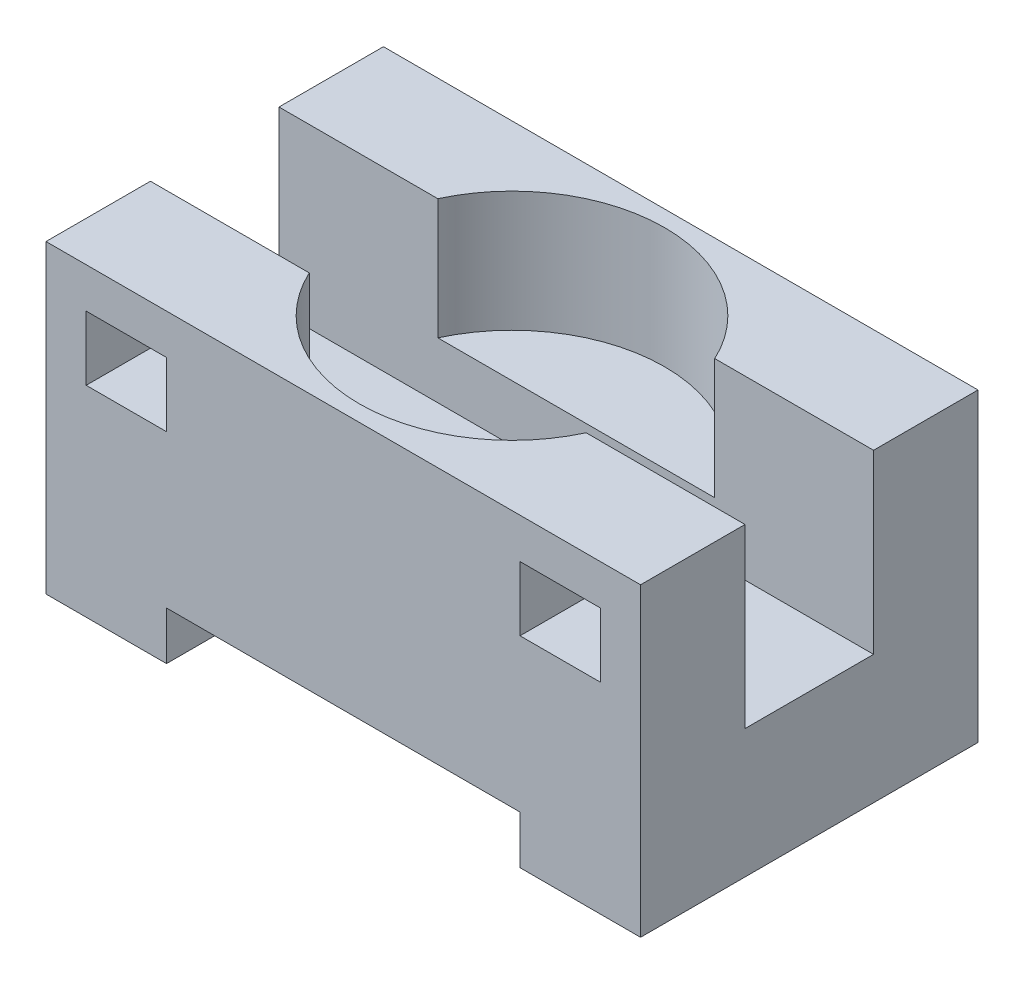
ISO-10303-21;
HEADER;
FILE_DESCRIPTION(('STEP AP214'),'2;1');
FILE_NAME('part.step','',(''),(''),'','','');
FILE_SCHEMA(('AUTOMOTIVE_DESIGN { 1 0 10303 214 1 1 1 1 }'));
ENDSEC;
DATA;
#1=APPLICATION_CONTEXT('core data for automotive mechanical design processes');
#2=APPLICATION_PROTOCOL_DEFINITION('international standard','automotive_design',2000,#1);
#3=PRODUCT_CONTEXT('',#1,'mechanical');
#4=PRODUCT('Part','Part','',(#3));
#5=PRODUCT_RELATED_PRODUCT_CATEGORY('part','',(#4));
#6=PRODUCT_DEFINITION_FORMATION('','',#4);
#7=PRODUCT_DEFINITION_CONTEXT('part definition',#1,'design');
#8=PRODUCT_DEFINITION('design','',#6,#7);
#9=PRODUCT_DEFINITION_SHAPE('','',#8);
#10=(LENGTH_UNIT() NAMED_UNIT(*) SI_UNIT(.MILLI.,.METRE.));
#11=(NAMED_UNIT(*) PLANE_ANGLE_UNIT() SI_UNIT($,.RADIAN.));
#12=(NAMED_UNIT(*) SI_UNIT($,.STERADIAN.) SOLID_ANGLE_UNIT());
#13=UNCERTAINTY_MEASURE_WITH_UNIT(LENGTH_MEASURE(1.E-05),#10,'distance_accuracy_value','');
#14=(GEOMETRIC_REPRESENTATION_CONTEXT(3) GLOBAL_UNCERTAINTY_ASSIGNED_CONTEXT((#13)) GLOBAL_UNIT_ASSIGNED_CONTEXT((#10,
#11,#12)) REPRESENTATION_CONTEXT('',''));
#15=CARTESIAN_POINT('',(0.,0.,0.));
#16=DIRECTION('',(0.,0.,1.));
#17=DIRECTION('',(1.,0.,0.));
#18=AXIS2_PLACEMENT_3D('',#15,#16,#17);
#19=CARTESIAN_POINT('',(-37.,19.,42.));
#20=DIRECTION('',(0.,-1.,0.));
#21=DIRECTION('',(0.,0.,-1.));
#22=AXIS2_PLACEMENT_3D('',#19,#20,#21);
#23=PLANE('',#22);
#24=DIRECTION('',(1.,0.,0.));
#25=VECTOR('',#24,1.);
#26=CARTESIAN_POINT('',(-37.,19.,29.));
#27=LINE('',#26,#25);
#28=CARTESIAN_POINT('',(17.2336879396141,19.,29.));
#29=VERTEX_POINT('',#28);
#30=CARTESIAN_POINT('',(37.,19.,29.));
#31=VERTEX_POINT('',#30);
#32=EDGE_CURVE('E288',#29,#31,#27,.T.);
#33=ORIENTED_EDGE('',*,*,#32,.F.);
#34=CARTESIAN_POINT('',(0.,19.,21.));
#35=DIRECTION('',(0.,1.,0.));
#36=DIRECTION('',(0.,0.,1.));
#37=AXIS2_PLACEMENT_3D('',#34,#35,#36);
#38=CIRCLE('',#37,19.);
#39=CARTESIAN_POINT('',(-17.2336879396141,19.,29.));
#40=VERTEX_POINT('',#39);
#41=EDGE_CURVE('E231',#40,#29,#38,.T.);
#42=ORIENTED_EDGE('',*,*,#41,.F.);
#43=CARTESIAN_POINT('',(-37.,19.,29.));
#44=VERTEX_POINT('',#43);
#45=EDGE_CURVE('E284',#44,#40,#27,.T.);
#46=ORIENTED_EDGE('',*,*,#45,.F.);
#47=DIRECTION('',(0.,0.,-1.));
#48=VECTOR('',#47,1.);
#49=CARTESIAN_POINT('',(-37.,19.,42.));
#50=LINE('',#49,#48);
#51=CARTESIAN_POINT('',(-37.,19.,42.));
#52=VERTEX_POINT('',#51);
#53=EDGE_CURVE('E351',#52,#44,#50,.T.);
#54=ORIENTED_EDGE('',*,*,#53,.F.);
#55=DIRECTION('',(-1.,0.,0.));
#56=VECTOR('',#55,1.);
#57=CARTESIAN_POINT('',(-37.,19.,42.));
#58=LINE('',#57,#56);
#59=CARTESIAN_POINT('',(37.,19.,42.));
#60=VERTEX_POINT('',#59);
#61=EDGE_CURVE('E325',#60,#52,#58,.T.);
#62=ORIENTED_EDGE('',*,*,#61,.F.);
#63=DIRECTION('',(0.,0.,-1.));
#64=VECTOR('',#63,1.);
#65=CARTESIAN_POINT('',(37.,19.,42.));
#66=LINE('',#65,#64);
#67=EDGE_CURVE('E355',#60,#31,#66,.T.);
#68=ORIENTED_EDGE('',*,*,#67,.T.);
#69=EDGE_LOOP('',(#33,#42,#46,#54,#62,#68));
#70=FACE_BOUND('',#69,.T.);
#71=ADVANCED_FACE('F39',(#70),#23,.F.);
#72=CARTESIAN_POINT('',(-37.,-19.,42.));
#73=DIRECTION('',(0.,1.,0.));
#74=DIRECTION('',(0.,0.,1.));
#75=AXIS2_PLACEMENT_3D('',#72,#73,#74);
#76=PLANE('',#75);
#77=DIRECTION('',(1.,0.,0.));
#78=VECTOR('',#77,1.);
#79=CARTESIAN_POINT('',(-37.,-19.,42.));
#80=LINE('',#79,#78);
#81=CARTESIAN_POINT('',(22.,-19.,42.));
#82=VERTEX_POINT('',#81);
#83=CARTESIAN_POINT('',(37.,-19.,42.));
#84=VERTEX_POINT('',#83);
#85=EDGE_CURVE('E330',#82,#84,#80,.T.);
#86=ORIENTED_EDGE('',*,*,#85,.F.);
#87=DIRECTION('',(0.,0.,-1.));
#88=VECTOR('',#87,1.);
#89=CARTESIAN_POINT('',(22.,-19.,42.));
#90=LINE('',#89,#88);
#91=CARTESIAN_POINT('',(22.,-19.,0.));
#92=VERTEX_POINT('',#91);
#93=EDGE_CURVE('E306',#82,#92,#90,.T.);
#94=ORIENTED_EDGE('',*,*,#93,.T.);
#95=DIRECTION('',(1.,0.,0.));
#96=VECTOR('',#95,1.);
#97=CARTESIAN_POINT('',(-37.,-19.,0.));
#98=LINE('',#97,#96);
#99=CARTESIAN_POINT('',(37.,-19.,0.));
#100=VERTEX_POINT('',#99);
#101=EDGE_CURVE('E342',#92,#100,#98,.T.);
#102=ORIENTED_EDGE('',*,*,#101,.T.);
#103=DIRECTION('',(0.,0.,-1.));
#104=VECTOR('',#103,1.);
#105=CARTESIAN_POINT('',(37.,-19.,42.));
#106=LINE('',#105,#104);
#107=EDGE_CURVE('E334',#84,#100,#106,.T.);
#108=ORIENTED_EDGE('',*,*,#107,.F.);
#109=EDGE_LOOP('',(#86,#94,#102,#108));
#110=FACE_BOUND('',#109,.T.);
#111=ADVANCED_FACE('F402',(#110),#76,.F.);
#112=CARTESIAN_POINT('',(37.,19.,42.));
#113=DIRECTION('',(-1.,0.,0.));
#114=DIRECTION('',(0.,0.,1.));
#115=AXIS2_PLACEMENT_3D('',#112,#113,#114);
#116=PLANE('',#115);
#117=DIRECTION('',(0.,0.,-1.));
#118=VECTOR('',#117,1.);
#119=CARTESIAN_POINT('',(37.,-3.,29.));
#120=LINE('',#119,#118);
#121=CARTESIAN_POINT('',(37.,-3.,29.));
#122=VERTEX_POINT('',#121);
#123=CARTESIAN_POINT('',(37.,-3.,13.));
#124=VERTEX_POINT('',#123);
#125=EDGE_CURVE('E279',#122,#124,#120,.T.);
#126=ORIENTED_EDGE('',*,*,#125,.F.);
#127=DIRECTION('',(0.,-1.,0.));
#128=VECTOR('',#127,1.);
#129=CARTESIAN_POINT('',(37.,19.,29.));
#130=LINE('',#129,#128);
#131=EDGE_CURVE('E265',#31,#122,#130,.T.);
#132=ORIENTED_EDGE('',*,*,#131,.F.);
#133=ORIENTED_EDGE('',*,*,#67,.F.);
#134=DIRECTION('',(0.,1.,0.));
#135=VECTOR('',#134,1.);
#136=CARTESIAN_POINT('',(37.,19.,42.));
#137=LINE('',#136,#135);
#138=EDGE_CURVE('E322',#84,#60,#137,.T.);
#139=ORIENTED_EDGE('',*,*,#138,.F.);
#140=ORIENTED_EDGE('',*,*,#107,.T.);
#141=DIRECTION('',(0.,1.,0.));
#142=VECTOR('',#141,1.);
#143=CARTESIAN_POINT('',(37.,19.,0.));
#144=LINE('',#143,#142);
#145=CARTESIAN_POINT('',(37.,19.,0.));
#146=VERTEX_POINT('',#145);
#147=EDGE_CURVE('E315',#100,#146,#144,.T.);
#148=ORIENTED_EDGE('',*,*,#147,.T.);
#149=CARTESIAN_POINT('',(37.,19.,13.));
#150=VERTEX_POINT('',#149);
#151=EDGE_CURVE('E354',#150,#146,#66,.T.);
#152=ORIENTED_EDGE('',*,*,#151,.F.);
#153=DIRECTION('',(0.,1.,0.));
#154=VECTOR('',#153,1.);
#155=CARTESIAN_POINT('',(37.,19.,13.));
#156=LINE('',#155,#154);
#157=EDGE_CURVE('E270',#124,#150,#156,.T.);
#158=ORIENTED_EDGE('',*,*,#157,.F.);
#159=EDGE_LOOP('',(#126,#132,#133,#139,#140,#148,#152,#158));
#160=FACE_BOUND('',#159,.T.);
#161=ADVANCED_FACE('F41',(#160),#116,.F.);
#162=DIRECTION('',(1.,0.,0.));
#163=VECTOR('',#162,1.);
#164=CARTESIAN_POINT('',(-37.,19.,13.));
#165=LINE('',#164,#163);
#166=CARTESIAN_POINT('',(-37.,19.,13.));
#167=VERTEX_POINT('',#166);
#168=CARTESIAN_POINT('',(-17.2336879396141,19.,13.));
#169=VERTEX_POINT('',#168);
#170=EDGE_CURVE('E289',#167,#169,#165,.T.);
#171=ORIENTED_EDGE('',*,*,#170,.T.);
#172=CARTESIAN_POINT('',(17.2336879396141,19.,13.));
#173=VERTEX_POINT('',#172);
#174=EDGE_CURVE('E255',#173,#169,#38,.T.);
#175=ORIENTED_EDGE('',*,*,#174,.F.);
#176=EDGE_CURVE('E292',#173,#150,#165,.T.);
#177=ORIENTED_EDGE('',*,*,#176,.T.);
#178=ORIENTED_EDGE('',*,*,#151,.T.);
#179=DIRECTION('',(-1.,0.,0.));
#180=VECTOR('',#179,1.);
#181=CARTESIAN_POINT('',(-37.,19.,0.));
#182=LINE('',#181,#180);
#183=CARTESIAN_POINT('',(-37.,19.,0.));
#184=VERTEX_POINT('',#183);
#185=EDGE_CURVE('E337',#146,#184,#182,.T.);
#186=ORIENTED_EDGE('',*,*,#185,.T.);
#187=EDGE_CURVE('E350',#167,#184,#50,.T.);
#188=ORIENTED_EDGE('',*,*,#187,.F.);
#189=EDGE_LOOP('',(#171,#175,#177,#178,#186,#188));
#190=FACE_BOUND('',#189,.T.);
#191=ADVANCED_FACE('F404',(#190),#23,.F.);
#192=CARTESIAN_POINT('',(-37.,19.,42.));
#193=DIRECTION('',(1.,0.,0.));
#194=DIRECTION('',(0.,0.,-1.));
#195=AXIS2_PLACEMENT_3D('',#192,#193,#194);
#196=PLANE('',#195);
#197=ORIENTED_EDGE('',*,*,#53,.T.);
#198=DIRECTION('',(0.,-1.,0.));
#199=VECTOR('',#198,1.);
#200=CARTESIAN_POINT('',(-37.,19.,29.));
#201=LINE('',#200,#199);
#202=CARTESIAN_POINT('',(-37.,-3.,29.));
#203=VERTEX_POINT('',#202);
#204=EDGE_CURVE('E266',#44,#203,#201,.T.);
#205=ORIENTED_EDGE('',*,*,#204,.T.);
#206=DIRECTION('',(0.,0.,-1.));
#207=VECTOR('',#206,1.);
#208=CARTESIAN_POINT('',(-37.,-3.,29.));
#209=LINE('',#208,#207);
#210=CARTESIAN_POINT('',(-37.,-3.,13.));
#211=VERTEX_POINT('',#210);
#212=EDGE_CURVE('E269',#203,#211,#209,.T.);
#213=ORIENTED_EDGE('',*,*,#212,.T.);
#214=DIRECTION('',(0.,1.,0.));
#215=VECTOR('',#214,1.);
#216=CARTESIAN_POINT('',(-37.,19.,13.));
#217=LINE('',#216,#215);
#218=EDGE_CURVE('E273',#211,#167,#217,.T.);
#219=ORIENTED_EDGE('',*,*,#218,.T.);
#220=ORIENTED_EDGE('',*,*,#187,.T.);
#221=DIRECTION('',(0.,-1.,0.));
#222=VECTOR('',#221,1.);
#223=CARTESIAN_POINT('',(-37.,19.,0.));
#224=LINE('',#223,#222);
#225=CARTESIAN_POINT('',(-37.,-19.,0.));
#226=VERTEX_POINT('',#225);
#227=EDGE_CURVE('E340',#184,#226,#224,.T.);
#228=ORIENTED_EDGE('',*,*,#227,.T.);
#229=DIRECTION('',(0.,0.,-1.));
#230=VECTOR('',#229,1.);
#231=CARTESIAN_POINT('',(-37.,-19.,42.));
#232=LINE('',#231,#230);
#233=CARTESIAN_POINT('',(-37.,-19.,42.));
#234=VERTEX_POINT('',#233);
#235=EDGE_CURVE('E347',#234,#226,#232,.T.);
#236=ORIENTED_EDGE('',*,*,#235,.F.);
#237=DIRECTION('',(0.,-1.,0.));
#238=VECTOR('',#237,1.);
#239=CARTESIAN_POINT('',(-37.,19.,42.));
#240=LINE('',#239,#238);
#241=EDGE_CURVE('E328',#52,#234,#240,.T.);
#242=ORIENTED_EDGE('',*,*,#241,.F.);
#243=EDGE_LOOP('',(#197,#205,#213,#219,#220,#228,#236,#242));
#244=FACE_BOUND('',#243,.T.);
#245=ADVANCED_FACE('F415',(#244),#196,.F.);
#246=CARTESIAN_POINT('',(-22.,-19.,0.));
#247=VERTEX_POINT('',#246);
#248=EDGE_CURVE('E326',#226,#247,#98,.T.);
#249=ORIENTED_EDGE('',*,*,#248,.T.);
#250=DIRECTION('',(0.,0.,-1.));
#251=VECTOR('',#250,1.);
#252=CARTESIAN_POINT('',(-22.,-19.,42.));
#253=LINE('',#252,#251);
#254=CARTESIAN_POINT('',(-22.,-19.,42.));
#255=VERTEX_POINT('',#254);
#256=EDGE_CURVE('E318',#255,#247,#253,.T.);
#257=ORIENTED_EDGE('',*,*,#256,.F.);
#258=EDGE_CURVE('E331',#234,#255,#80,.T.);
#259=ORIENTED_EDGE('',*,*,#258,.F.);
#260=ORIENTED_EDGE('',*,*,#235,.T.);
#261=EDGE_LOOP('',(#249,#257,#259,#260));
#262=FACE_BOUND('',#261,.T.);
#263=ADVANCED_FACE('F412',(#262),#76,.F.);
#264=CARTESIAN_POINT('',(0.,0.,42.));
#265=DIRECTION('',(0.,0.,1.));
#266=DIRECTION('',(1.,0.,0.));
#267=AXIS2_PLACEMENT_3D('',#264,#265,#266);
#268=PLANE('',#267);
#269=DIRECTION('',(0.,-1.,0.));
#270=VECTOR('',#269,1.);
#271=CARTESIAN_POINT('',(-32.,14.,42.));
#272=LINE('',#271,#270);
#273=CARTESIAN_POINT('',(-32.,14.,42.));
#274=VERTEX_POINT('',#273);
#275=CARTESIAN_POINT('',(-32.,6.,42.));
#276=VERTEX_POINT('',#275);
#277=EDGE_CURVE('E54',#274,#276,#272,.T.);
#278=ORIENTED_EDGE('',*,*,#277,.F.);
#279=DIRECTION('',(-1.,0.,0.));
#280=VECTOR('',#279,1.);
#281=CARTESIAN_POINT('',(-32.,14.,42.));
#282=LINE('',#281,#280);
#283=CARTESIAN_POINT('',(-22.,14.,42.));
#284=VERTEX_POINT('',#283);
#285=EDGE_CURVE('E224',#284,#274,#282,.T.);
#286=ORIENTED_EDGE('',*,*,#285,.F.);
#287=DIRECTION('',(0.,1.,0.));
#288=VECTOR('',#287,1.);
#289=CARTESIAN_POINT('',(-22.,14.,42.));
#290=LINE('',#289,#288);
#291=CARTESIAN_POINT('',(-22.,6.,42.));
#292=VERTEX_POINT('',#291);
#293=EDGE_CURVE('E207',#292,#284,#290,.T.);
#294=ORIENTED_EDGE('',*,*,#293,.F.);
#295=DIRECTION('',(1.,0.,0.));
#296=VECTOR('',#295,1.);
#297=CARTESIAN_POINT('',(-32.,6.,42.));
#298=LINE('',#297,#296);
#299=EDGE_CURVE('E217',#276,#292,#298,.T.);
#300=ORIENTED_EDGE('',*,*,#299,.F.);
#301=EDGE_LOOP('',(#278,#286,#294,#300));
#302=FACE_BOUND('',#301,.T.);
#303=DIRECTION('',(-1.,0.,0.));
#304=VECTOR('',#303,1.);
#305=CARTESIAN_POINT('',(32.,14.,42.));
#306=LINE('',#305,#304);
#307=CARTESIAN_POINT('',(32.,14.,42.));
#308=VERTEX_POINT('',#307);
#309=CARTESIAN_POINT('',(22.,14.,42.));
#310=VERTEX_POINT('',#309);
#311=EDGE_CURVE('E62',#308,#310,#306,.T.);
#312=ORIENTED_EDGE('',*,*,#311,.F.);
#313=DIRECTION('',(0.,1.,0.));
#314=VECTOR('',#313,1.);
#315=CARTESIAN_POINT('',(32.,14.,42.));
#316=LINE('',#315,#314);
#317=CARTESIAN_POINT('',(32.,6.,42.));
#318=VERTEX_POINT('',#317);
#319=EDGE_CURVE('E236',#318,#308,#316,.T.);
#320=ORIENTED_EDGE('',*,*,#319,.F.);
#321=DIRECTION('',(1.,0.,0.));
#322=VECTOR('',#321,1.);
#323=CARTESIAN_POINT('',(32.,6.,42.));
#324=LINE('',#323,#322);
#325=CARTESIAN_POINT('',(22.,6.,42.));
#326=VERTEX_POINT('',#325);
#327=EDGE_CURVE('E245',#326,#318,#324,.T.);
#328=ORIENTED_EDGE('',*,*,#327,.F.);
#329=DIRECTION('',(0.,-1.,0.));
#330=VECTOR('',#329,1.);
#331=CARTESIAN_POINT('',(22.,14.,42.));
#332=LINE('',#331,#330);
#333=EDGE_CURVE('E248',#310,#326,#332,.T.);
#334=ORIENTED_EDGE('',*,*,#333,.F.);
#335=EDGE_LOOP('',(#312,#320,#328,#334));
#336=FACE_BOUND('',#335,.T.);
#337=DIRECTION('',(0.,-1.,0.));
#338=VECTOR('',#337,1.);
#339=CARTESIAN_POINT('',(22.,-19.,42.));
#340=LINE('',#339,#338);
#341=CARTESIAN_POINT('',(22.,-13.,42.));
#342=VERTEX_POINT('',#341);
#343=EDGE_CURVE('E296',#342,#82,#340,.T.);
#344=ORIENTED_EDGE('',*,*,#343,.T.);
#345=ORIENTED_EDGE('',*,*,#85,.T.);
#346=ORIENTED_EDGE('',*,*,#138,.T.);
#347=ORIENTED_EDGE('',*,*,#61,.T.);
#348=ORIENTED_EDGE('',*,*,#241,.T.);
#349=ORIENTED_EDGE('',*,*,#258,.T.);
#350=DIRECTION('',(0.,1.,0.));
#351=VECTOR('',#350,1.);
#352=CARTESIAN_POINT('',(-22.,-19.,42.));
#353=LINE('',#352,#351);
#354=CARTESIAN_POINT('',(-22.,-13.,42.));
#355=VERTEX_POINT('',#354);
#356=EDGE_CURVE('E299',#255,#355,#353,.T.);
#357=ORIENTED_EDGE('',*,*,#356,.T.);
#358=DIRECTION('',(1.,0.,0.));
#359=VECTOR('',#358,1.);
#360=CARTESIAN_POINT('',(22.,-13.,42.));
#361=LINE('',#360,#359);
#362=EDGE_CURVE('E303',#355,#342,#361,.T.);
#363=ORIENTED_EDGE('',*,*,#362,.T.);
#364=EDGE_LOOP('',(#344,#345,#346,#347,#348,#349,#357,#363));
#365=FACE_BOUND('',#364,.T.);
#366=ADVANCED_FACE('F221',(#302,#336,#365),#268,.T.);
#367=CARTESIAN_POINT('',(0.,0.,0.));
#368=DIRECTION('',(0.,0.,1.));
#369=DIRECTION('',(1.,0.,0.));
#370=AXIS2_PLACEMENT_3D('',#367,#368,#369);
#371=PLANE('',#370);
#372=ORIENTED_EDGE('',*,*,#101,.F.);
#373=DIRECTION('',(0.,-1.,0.));
#374=VECTOR('',#373,1.);
#375=CARTESIAN_POINT('',(22.,-19.,0.));
#376=LINE('',#375,#374);
#377=CARTESIAN_POINT('',(22.,-13.,0.));
#378=VERTEX_POINT('',#377);
#379=EDGE_CURVE('E287',#378,#92,#376,.T.);
#380=ORIENTED_EDGE('',*,*,#379,.F.);
#381=DIRECTION('',(1.,0.,0.));
#382=VECTOR('',#381,1.);
#383=CARTESIAN_POINT('',(22.,-13.,0.));
#384=LINE('',#383,#382);
#385=CARTESIAN_POINT('',(-22.,-13.,0.));
#386=VERTEX_POINT('',#385);
#387=EDGE_CURVE('E300',#386,#378,#384,.T.);
#388=ORIENTED_EDGE('',*,*,#387,.F.);
#389=DIRECTION('',(0.,1.,0.));
#390=VECTOR('',#389,1.);
#391=CARTESIAN_POINT('',(-22.,-19.,0.));
#392=LINE('',#391,#390);
#393=EDGE_CURVE('E308',#247,#386,#392,.T.);
#394=ORIENTED_EDGE('',*,*,#393,.F.);
#395=ORIENTED_EDGE('',*,*,#248,.F.);
#396=ORIENTED_EDGE('',*,*,#227,.F.);
#397=ORIENTED_EDGE('',*,*,#185,.F.);
#398=ORIENTED_EDGE('',*,*,#147,.F.);
#399=EDGE_LOOP('',(#372,#380,#388,#394,#395,#396,#397,#398));
#400=FACE_BOUND('',#399,.T.);
#401=ADVANCED_FACE('F443',(#400),#371,.F.);
#402=CARTESIAN_POINT('',(22.,-19.,42.));
#403=DIRECTION('',(1.,0.,0.));
#404=DIRECTION('',(0.,0.,-1.));
#405=AXIS2_PLACEMENT_3D('',#402,#403,#404);
#406=PLANE('',#405);
#407=ORIENTED_EDGE('',*,*,#379,.T.);
#408=ORIENTED_EDGE('',*,*,#93,.F.);
#409=ORIENTED_EDGE('',*,*,#343,.F.);
#410=DIRECTION('',(0.,0.,-1.));
#411=VECTOR('',#410,1.);
#412=CARTESIAN_POINT('',(22.,-13.,42.));
#413=LINE('',#412,#411);
#414=EDGE_CURVE('E313',#342,#378,#413,.T.);
#415=ORIENTED_EDGE('',*,*,#414,.T.);
#416=EDGE_LOOP('',(#407,#408,#409,#415));
#417=FACE_BOUND('',#416,.T.);
#418=ADVANCED_FACE('F466',(#417),#406,.F.);
#419=CARTESIAN_POINT('',(22.,-13.,42.));
#420=DIRECTION('',(0.,1.,0.));
#421=DIRECTION('',(0.,0.,1.));
#422=AXIS2_PLACEMENT_3D('',#419,#420,#421);
#423=PLANE('',#422);
#424=ORIENTED_EDGE('',*,*,#387,.T.);
#425=ORIENTED_EDGE('',*,*,#414,.F.);
#426=ORIENTED_EDGE('',*,*,#362,.F.);
#427=DIRECTION('',(0.,0.,-1.));
#428=VECTOR('',#427,1.);
#429=CARTESIAN_POINT('',(-22.,-13.,42.));
#430=LINE('',#429,#428);
#431=EDGE_CURVE('E316',#355,#386,#430,.T.);
#432=ORIENTED_EDGE('',*,*,#431,.T.);
#433=EDGE_LOOP('',(#424,#425,#426,#432));
#434=FACE_BOUND('',#433,.T.);
#435=ADVANCED_FACE('F469',(#434),#423,.F.);
#436=CARTESIAN_POINT('',(-22.,-19.,42.));
#437=DIRECTION('',(-1.,0.,0.));
#438=DIRECTION('',(0.,0.,1.));
#439=AXIS2_PLACEMENT_3D('',#436,#437,#438);
#440=PLANE('',#439);
#441=ORIENTED_EDGE('',*,*,#393,.T.);
#442=ORIENTED_EDGE('',*,*,#431,.F.);
#443=ORIENTED_EDGE('',*,*,#356,.F.);
#444=ORIENTED_EDGE('',*,*,#256,.T.);
#445=EDGE_LOOP('',(#441,#442,#443,#444));
#446=FACE_BOUND('',#445,.T.);
#447=ADVANCED_FACE('F471',(#446),#440,.F.);
#448=CARTESIAN_POINT('',(-37.,19.,29.));
#449=DIRECTION('',(0.,0.,1.));
#450=DIRECTION('',(0.,-1.,0.));
#451=AXIS2_PLACEMENT_3D('',#448,#449,#450);
#452=PLANE('',#451);
#453=DIRECTION('',(-1.,0.,0.));
#454=VECTOR('',#453,1.);
#455=CARTESIAN_POINT('',(-37.,14.,29.));
#456=LINE('',#455,#454);
#457=CARTESIAN_POINT('',(-22.,14.,29.));
#458=VERTEX_POINT('',#457);
#459=CARTESIAN_POINT('',(-32.,14.,29.));
#460=VERTEX_POINT('',#459);
#461=EDGE_CURVE('E47',#458,#460,#456,.T.);
#462=ORIENTED_EDGE('',*,*,#461,.T.);
#463=DIRECTION('',(0.,-1.,0.));
#464=VECTOR('',#463,1.);
#465=CARTESIAN_POINT('',(-32.,19.,29.));
#466=LINE('',#465,#464);
#467=CARTESIAN_POINT('',(-32.,6.,29.));
#468=VERTEX_POINT('',#467);
#469=EDGE_CURVE('E11',#460,#468,#466,.T.);
#470=ORIENTED_EDGE('',*,*,#469,.T.);
#471=DIRECTION('',(1.,0.,0.));
#472=VECTOR('',#471,1.);
#473=CARTESIAN_POINT('',(-37.,6.,29.));
#474=LINE('',#473,#472);
#475=CARTESIAN_POINT('',(-22.,6.,29.));
#476=VERTEX_POINT('',#475);
#477=EDGE_CURVE('E378',#468,#476,#474,.T.);
#478=ORIENTED_EDGE('',*,*,#477,.T.);
#479=DIRECTION('',(0.,1.,0.));
#480=VECTOR('',#479,1.);
#481=CARTESIAN_POINT('',(-22.,19.,29.));
#482=LINE('',#481,#480);
#483=EDGE_CURVE('E210',#476,#458,#482,.T.);
#484=ORIENTED_EDGE('',*,*,#483,.T.);
#485=EDGE_LOOP('',(#462,#470,#478,#484));
#486=FACE_BOUND('',#485,.T.);
#487=DIRECTION('',(0.,1.,0.));
#488=VECTOR('',#487,1.);
#489=CARTESIAN_POINT('',(32.,19.,29.));
#490=LINE('',#489,#488);
#491=CARTESIAN_POINT('',(32.,6.,29.));
#492=VERTEX_POINT('',#491);
#493=CARTESIAN_POINT('',(32.,14.,29.));
#494=VERTEX_POINT('',#493);
#495=EDGE_CURVE('E372',#492,#494,#490,.T.);
#496=ORIENTED_EDGE('',*,*,#495,.T.);
#497=DIRECTION('',(-1.,0.,0.));
#498=VECTOR('',#497,1.);
#499=CARTESIAN_POINT('',(-37.,14.,29.));
#500=LINE('',#499,#498);
#501=CARTESIAN_POINT('',(22.,14.,29.));
#502=VERTEX_POINT('',#501);
#503=EDGE_CURVE('E375',#494,#502,#500,.T.);
#504=ORIENTED_EDGE('',*,*,#503,.T.);
#505=DIRECTION('',(0.,-1.,0.));
#506=VECTOR('',#505,1.);
#507=CARTESIAN_POINT('',(22.,19.,29.));
#508=LINE('',#507,#506);
#509=CARTESIAN_POINT('',(22.,6.,29.));
#510=VERTEX_POINT('',#509);
#511=EDGE_CURVE('E366',#502,#510,#508,.T.);
#512=ORIENTED_EDGE('',*,*,#511,.T.);
#513=DIRECTION('',(1.,0.,0.));
#514=VECTOR('',#513,1.);
#515=CARTESIAN_POINT('',(-37.,6.,29.));
#516=LINE('',#515,#514);
#517=EDGE_CURVE('E369',#510,#492,#516,.T.);
#518=ORIENTED_EDGE('',*,*,#517,.T.);
#519=EDGE_LOOP('',(#496,#504,#512,#518));
#520=FACE_BOUND('',#519,.T.);
#521=DIRECTION('',(-1.,0.,0.));
#522=VECTOR('',#521,1.);
#523=CARTESIAN_POINT('',(-37.,4.,29.));
#524=LINE('',#523,#522);
#525=CARTESIAN_POINT('',(17.2336879396141,4.,29.));
#526=VERTEX_POINT('',#525);
#527=CARTESIAN_POINT('',(-17.2336879396141,4.,29.));
#528=VERTEX_POINT('',#527);
#529=EDGE_CURVE('E257',#526,#528,#524,.T.);
#530=ORIENTED_EDGE('',*,*,#529,.F.);
#531=DIRECTION('',(0.,1.,0.));
#532=VECTOR('',#531,1.);
#533=CARTESIAN_POINT('',(17.2336879396141,4.,29.));
#534=LINE('',#533,#532);
#535=EDGE_CURVE('E262',#526,#29,#534,.T.);
#536=ORIENTED_EDGE('',*,*,#535,.T.);
#537=ORIENTED_EDGE('',*,*,#32,.T.);
#538=ORIENTED_EDGE('',*,*,#131,.T.);
#539=DIRECTION('',(1.,0.,0.));
#540=VECTOR('',#539,1.);
#541=CARTESIAN_POINT('',(-37.,-3.,29.));
#542=LINE('',#541,#540);
#543=EDGE_CURVE('E276',#203,#122,#542,.T.);
#544=ORIENTED_EDGE('',*,*,#543,.F.);
#545=ORIENTED_EDGE('',*,*,#204,.F.);
#546=ORIENTED_EDGE('',*,*,#45,.T.);
#547=DIRECTION('',(0.,1.,0.));
#548=VECTOR('',#547,1.);
#549=CARTESIAN_POINT('',(-17.2336879396141,4.,29.));
#550=LINE('',#549,#548);
#551=EDGE_CURVE('E259',#40,#528,#550,.F.);
#552=ORIENTED_EDGE('',*,*,#551,.T.);
#553=EDGE_LOOP('',(#530,#536,#537,#538,#544,#545,#546,#552));
#554=FACE_BOUND('',#553,.T.);
#555=ADVANCED_FACE('F382',(#486,#520,#554),#452,.F.);
#556=CARTESIAN_POINT('',(-37.,19.,13.));
#557=DIRECTION('',(0.,0.,-1.));
#558=DIRECTION('',(0.,1.,0.));
#559=AXIS2_PLACEMENT_3D('',#556,#557,#558);
#560=PLANE('',#559);
#561=DIRECTION('',(1.,0.,0.));
#562=VECTOR('',#561,1.);
#563=CARTESIAN_POINT('',(-37.,4.,13.));
#564=LINE('',#563,#562);
#565=CARTESIAN_POINT('',(-17.2336879396141,4.,13.));
#566=VERTEX_POINT('',#565);
#567=CARTESIAN_POINT('',(17.2336879396141,4.,13.));
#568=VERTEX_POINT('',#567);
#569=EDGE_CURVE('E358',#566,#568,#564,.T.);
#570=ORIENTED_EDGE('',*,*,#569,.F.);
#571=DIRECTION('',(0.,1.,0.));
#572=VECTOR('',#571,1.);
#573=CARTESIAN_POINT('',(-17.2336879396141,4.,13.));
#574=LINE('',#573,#572);
#575=EDGE_CURVE('E363',#566,#169,#574,.T.);
#576=ORIENTED_EDGE('',*,*,#575,.T.);
#577=ORIENTED_EDGE('',*,*,#170,.F.);
#578=ORIENTED_EDGE('',*,*,#218,.F.);
#579=DIRECTION('',(1.,0.,0.));
#580=VECTOR('',#579,1.);
#581=CARTESIAN_POINT('',(-37.,-3.,13.));
#582=LINE('',#581,#580);
#583=EDGE_CURVE('E293',#211,#124,#582,.T.);
#584=ORIENTED_EDGE('',*,*,#583,.T.);
#585=ORIENTED_EDGE('',*,*,#157,.T.);
#586=ORIENTED_EDGE('',*,*,#176,.F.);
#587=DIRECTION('',(0.,1.,0.));
#588=VECTOR('',#587,1.);
#589=CARTESIAN_POINT('',(17.2336879396141,4.,13.));
#590=LINE('',#589,#588);
#591=EDGE_CURVE('E360',#173,#568,#590,.F.);
#592=ORIENTED_EDGE('',*,*,#591,.T.);
#593=EDGE_LOOP('',(#570,#576,#577,#578,#584,#585,#586,#592));
#594=FACE_BOUND('',#593,.T.);
#595=ADVANCED_FACE('F429',(#594),#560,.F.);
#596=CARTESIAN_POINT('',(-37.,-3.,29.));
#597=DIRECTION('',(0.,-1.,0.));
#598=DIRECTION('',(0.,0.,-1.));
#599=AXIS2_PLACEMENT_3D('',#596,#597,#598);
#600=PLANE('',#599);
#601=ORIENTED_EDGE('',*,*,#125,.T.);
#602=ORIENTED_EDGE('',*,*,#583,.F.);
#603=ORIENTED_EDGE('',*,*,#212,.F.);
#604=ORIENTED_EDGE('',*,*,#543,.T.);
#605=EDGE_LOOP('',(#601,#602,#603,#604));
#606=FACE_BOUND('',#605,.T.);
#607=ADVANCED_FACE('F434',(#606),#600,.F.);
#608=CARTESIAN_POINT('',(0.,4.,21.));
#609=DIRECTION('',(0.,1.,0.));
#610=DIRECTION('',(0.,0.,1.));
#611=AXIS2_PLACEMENT_3D('',#608,#609,#610);
#612=PLANE('',#611);
#613=ORIENTED_EDGE('',*,*,#569,.T.);
#614=CARTESIAN_POINT('',(0.,4.,21.));
#615=DIRECTION('',(0.,1.,0.));
#616=DIRECTION('',(0.,0.,1.));
#617=AXIS2_PLACEMENT_3D('',#614,#615,#616);
#618=CIRCLE('',#617,19.);
#619=EDGE_CURVE('E254',#568,#566,#618,.T.);
#620=ORIENTED_EDGE('',*,*,#619,.T.);
#621=EDGE_LOOP('',(#613,#620));
#622=FACE_BOUND('',#621,.T.);
#623=ADVANCED_FACE('F541',(#622),#612,.T.);
#624=CARTESIAN_POINT('',(0.,4.,21.));
#625=DIRECTION('',(0.,1.,0.));
#626=DIRECTION('',(0.,0.,1.));
#627=AXIS2_PLACEMENT_3D('',#624,#625,#626);
#628=CYLINDRICAL_SURFACE('',#627,19.);
#629=ORIENTED_EDGE('',*,*,#619,.F.);
#630=ORIENTED_EDGE('',*,*,#591,.F.);
#631=ORIENTED_EDGE('',*,*,#174,.T.);
#632=ORIENTED_EDGE('',*,*,#575,.F.);
#633=EDGE_LOOP('',(#629,#630,#631,#632));
#634=FACE_BOUND('',#633,.T.);
#635=ADVANCED_FACE('F549',(#634),#628,.F.);
#636=EDGE_CURVE('E252',#528,#526,#618,.T.);
#637=ORIENTED_EDGE('',*,*,#636,.F.);
#638=ORIENTED_EDGE('',*,*,#551,.F.);
#639=ORIENTED_EDGE('',*,*,#41,.T.);
#640=ORIENTED_EDGE('',*,*,#535,.F.);
#641=EDGE_LOOP('',(#637,#638,#639,#640));
#642=FACE_BOUND('',#641,.T.);
#643=ADVANCED_FACE('F560',(#642),#628,.F.);
#644=ORIENTED_EDGE('',*,*,#529,.T.);
#645=ORIENTED_EDGE('',*,*,#636,.T.);
#646=EDGE_LOOP('',(#644,#645));
#647=FACE_BOUND('',#646,.T.);
#648=ADVANCED_FACE('F552',(#647),#612,.T.);
#649=CARTESIAN_POINT('',(32.,14.,27.));
#650=DIRECTION('',(0.,1.,0.));
#651=DIRECTION('',(0.,0.,1.));
#652=AXIS2_PLACEMENT_3D('',#649,#650,#651);
#653=PLANE('',#652);
#654=DIRECTION('',(0.,0.,1.));
#655=VECTOR('',#654,1.);
#656=CARTESIAN_POINT('',(32.,14.,27.));
#657=LINE('',#656,#655);
#658=EDGE_CURVE('E241',#494,#308,#657,.T.);
#659=ORIENTED_EDGE('',*,*,#658,.T.);
#660=ORIENTED_EDGE('',*,*,#311,.T.);
#661=DIRECTION('',(0.,0.,1.));
#662=VECTOR('',#661,1.);
#663=CARTESIAN_POINT('',(22.,14.,27.));
#664=LINE('',#663,#662);
#665=EDGE_CURVE('E234',#502,#310,#664,.T.);
#666=ORIENTED_EDGE('',*,*,#665,.F.);
#667=ORIENTED_EDGE('',*,*,#503,.F.);
#668=EDGE_LOOP('',(#659,#660,#666,#667));
#669=FACE_BOUND('',#668,.T.);
#670=ADVANCED_FACE('F578',(#669),#653,.F.);
#671=CARTESIAN_POINT('',(32.,14.,27.));
#672=DIRECTION('',(1.,0.,0.));
#673=DIRECTION('',(0.,0.,-1.));
#674=AXIS2_PLACEMENT_3D('',#671,#672,#673);
#675=PLANE('',#674);
#676=DIRECTION('',(0.,0.,1.));
#677=VECTOR('',#676,1.);
#678=CARTESIAN_POINT('',(32.,6.,27.));
#679=LINE('',#678,#677);
#680=EDGE_CURVE('E239',#492,#318,#679,.T.);
#681=ORIENTED_EDGE('',*,*,#680,.T.);
#682=ORIENTED_EDGE('',*,*,#319,.T.);
#683=ORIENTED_EDGE('',*,*,#658,.F.);
#684=ORIENTED_EDGE('',*,*,#495,.F.);
#685=EDGE_LOOP('',(#681,#682,#683,#684));
#686=FACE_BOUND('',#685,.T.);
#687=ADVANCED_FACE('F586',(#686),#675,.F.);
#688=CARTESIAN_POINT('',(32.,6.,27.));
#689=DIRECTION('',(0.,-1.,0.));
#690=DIRECTION('',(0.,0.,-1.));
#691=AXIS2_PLACEMENT_3D('',#688,#689,#690);
#692=PLANE('',#691);
#693=DIRECTION('',(0.,0.,1.));
#694=VECTOR('',#693,1.);
#695=CARTESIAN_POINT('',(22.,6.,27.));
#696=LINE('',#695,#694);
#697=EDGE_CURVE('E237',#510,#326,#696,.T.);
#698=ORIENTED_EDGE('',*,*,#697,.T.);
#699=ORIENTED_EDGE('',*,*,#327,.T.);
#700=ORIENTED_EDGE('',*,*,#680,.F.);
#701=ORIENTED_EDGE('',*,*,#517,.F.);
#702=EDGE_LOOP('',(#698,#699,#700,#701));
#703=FACE_BOUND('',#702,.T.);
#704=ADVANCED_FACE('F396',(#703),#692,.F.);
#705=CARTESIAN_POINT('',(22.,14.,27.));
#706=DIRECTION('',(-1.,0.,0.));
#707=DIRECTION('',(0.,0.,1.));
#708=AXIS2_PLACEMENT_3D('',#705,#706,#707);
#709=PLANE('',#708);
#710=ORIENTED_EDGE('',*,*,#665,.T.);
#711=ORIENTED_EDGE('',*,*,#333,.T.);
#712=ORIENTED_EDGE('',*,*,#697,.F.);
#713=ORIENTED_EDGE('',*,*,#511,.F.);
#714=EDGE_LOOP('',(#710,#711,#712,#713));
#715=FACE_BOUND('',#714,.T.);
#716=ADVANCED_FACE('F389',(#715),#709,.F.);
#717=CARTESIAN_POINT('',(-32.,14.,27.));
#718=DIRECTION('',(-1.,0.,0.));
#719=DIRECTION('',(0.,0.,1.));
#720=AXIS2_PLACEMENT_3D('',#717,#718,#719);
#721=PLANE('',#720);
#722=DIRECTION('',(0.,0.,1.));
#723=VECTOR('',#722,1.);
#724=CARTESIAN_POINT('',(-32.,14.,27.));
#725=LINE('',#724,#723);
#726=EDGE_CURVE('E229',#460,#274,#725,.T.);
#727=ORIENTED_EDGE('',*,*,#726,.T.);
#728=ORIENTED_EDGE('',*,*,#277,.T.);
#729=DIRECTION('',(0.,0.,1.));
#730=VECTOR('',#729,1.);
#731=CARTESIAN_POINT('',(-32.,6.,27.));
#732=LINE('',#731,#730);
#733=EDGE_CURVE('E214',#468,#276,#732,.T.);
#734=ORIENTED_EDGE('',*,*,#733,.F.);
#735=ORIENTED_EDGE('',*,*,#469,.F.);
#736=EDGE_LOOP('',(#727,#728,#734,#735));
#737=FACE_BOUND('',#736,.T.);
#738=ADVANCED_FACE('F387',(#737),#721,.F.);
#739=CARTESIAN_POINT('',(-32.,14.,27.));
#740=DIRECTION('',(0.,1.,0.));
#741=DIRECTION('',(0.,0.,1.));
#742=AXIS2_PLACEMENT_3D('',#739,#740,#741);
#743=PLANE('',#742);
#744=DIRECTION('',(0.,0.,1.));
#745=VECTOR('',#744,1.);
#746=CARTESIAN_POINT('',(-22.,14.,27.));
#747=LINE('',#746,#745);
#748=EDGE_CURVE('E213',#458,#284,#747,.T.);
#749=ORIENTED_EDGE('',*,*,#748,.T.);
#750=ORIENTED_EDGE('',*,*,#285,.T.);
#751=ORIENTED_EDGE('',*,*,#726,.F.);
#752=ORIENTED_EDGE('',*,*,#461,.F.);
#753=EDGE_LOOP('',(#749,#750,#751,#752));
#754=FACE_BOUND('',#753,.T.);
#755=ADVANCED_FACE('F386',(#754),#743,.F.);
#756=CARTESIAN_POINT('',(-22.,14.,27.));
#757=DIRECTION('',(1.,0.,0.));
#758=DIRECTION('',(0.,0.,-1.));
#759=AXIS2_PLACEMENT_3D('',#756,#757,#758);
#760=PLANE('',#759);
#761=DIRECTION('',(0.,0.,1.));
#762=VECTOR('',#761,1.);
#763=CARTESIAN_POINT('',(-22.,6.,27.));
#764=LINE('',#763,#762);
#765=EDGE_CURVE('E202',#476,#292,#764,.T.);
#766=ORIENTED_EDGE('',*,*,#765,.T.);
#767=ORIENTED_EDGE('',*,*,#293,.T.);
#768=ORIENTED_EDGE('',*,*,#748,.F.);
#769=ORIENTED_EDGE('',*,*,#483,.F.);
#770=EDGE_LOOP('',(#766,#767,#768,#769));
#771=FACE_BOUND('',#770,.T.);
#772=ADVANCED_FACE('F204',(#771),#760,.F.);
#773=CARTESIAN_POINT('',(-32.,6.,27.));
#774=DIRECTION('',(0.,-1.,0.));
#775=DIRECTION('',(0.,0.,-1.));
#776=AXIS2_PLACEMENT_3D('',#773,#774,#775);
#777=PLANE('',#776);
#778=ORIENTED_EDGE('',*,*,#733,.T.);
#779=ORIENTED_EDGE('',*,*,#299,.T.);
#780=ORIENTED_EDGE('',*,*,#765,.F.);
#781=ORIENTED_EDGE('',*,*,#477,.F.);
#782=EDGE_LOOP('',(#778,#779,#780,#781));
#783=FACE_BOUND('',#782,.T.);
#784=ADVANCED_FACE('F218',(#783),#777,.F.);
#785=CLOSED_SHELL('',(#71,#111,#161,#191,#245,#263,#366,#401,#418,#435,#447,#555,#595,#607,#623,
#635,#643,#648,#670,#687,#704,#716,#738,#755,#772,#784));
#786=MANIFOLD_SOLID_BREP('B2',#785);
#787=ADVANCED_BREP_SHAPE_REPRESENTATION('',(#18,#786),#14);
#788=SHAPE_DEFINITION_REPRESENTATION(#9,#787);
ENDSEC;
END-ISO-10303-21;
